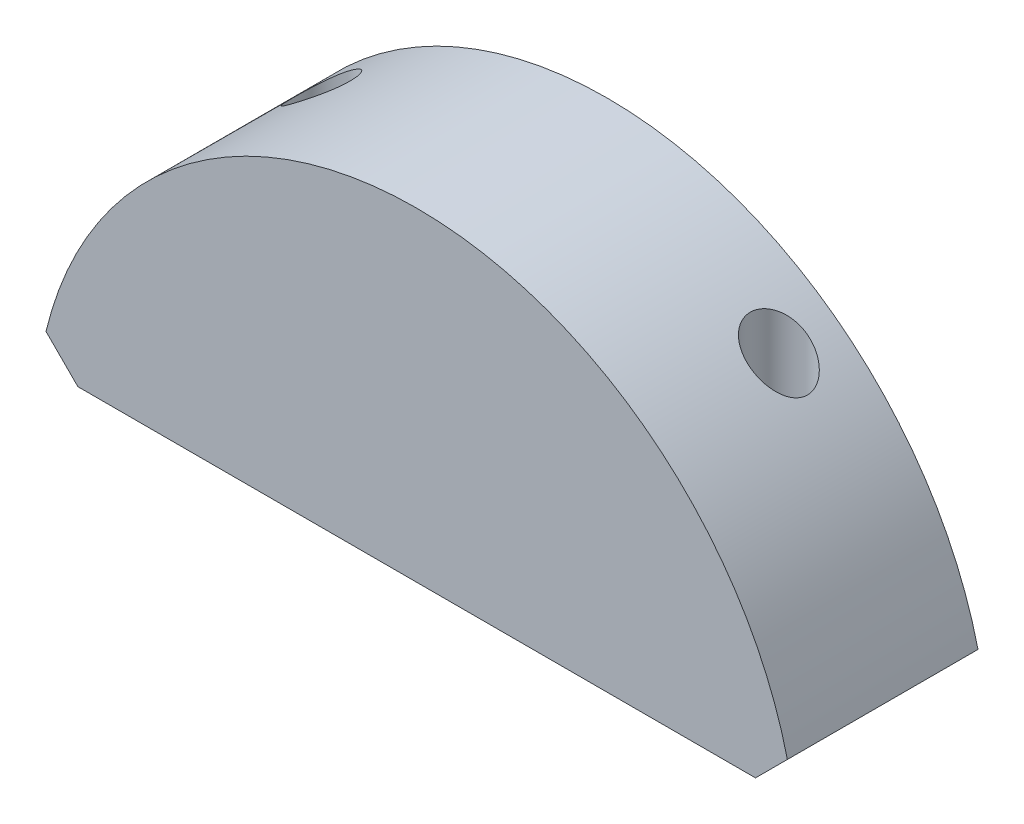
ISO-10303-21;
HEADER;
FILE_DESCRIPTION(('STEP AP214'),'2;1');
FILE_NAME('part.step','',(''),(''),'','','');
FILE_SCHEMA(('AUTOMOTIVE_DESIGN { 1 0 10303 214 1 1 1 1 }'));
ENDSEC;
DATA;
#1=APPLICATION_CONTEXT('core data for automotive mechanical design processes');
#2=APPLICATION_PROTOCOL_DEFINITION('international standard','automotive_design',2000,#1);
#3=PRODUCT_CONTEXT('',#1,'mechanical');
#4=PRODUCT('Part','Part','',(#3));
#5=PRODUCT_RELATED_PRODUCT_CATEGORY('part','',(#4));
#6=PRODUCT_DEFINITION_FORMATION('','',#4);
#7=PRODUCT_DEFINITION_CONTEXT('part definition',#1,'design');
#8=PRODUCT_DEFINITION('design','',#6,#7);
#9=PRODUCT_DEFINITION_SHAPE('','',#8);
#10=(LENGTH_UNIT() NAMED_UNIT(*) SI_UNIT(.MILLI.,.METRE.));
#11=(NAMED_UNIT(*) PLANE_ANGLE_UNIT() SI_UNIT($,.RADIAN.));
#12=(NAMED_UNIT(*) SI_UNIT($,.STERADIAN.) SOLID_ANGLE_UNIT());
#13=UNCERTAINTY_MEASURE_WITH_UNIT(LENGTH_MEASURE(1.E-05),#10,'distance_accuracy_value','');
#14=(GEOMETRIC_REPRESENTATION_CONTEXT(3) GLOBAL_UNCERTAINTY_ASSIGNED_CONTEXT((#13)) GLOBAL_UNIT_ASSIGNED_CONTEXT((#10,
#11,#12)) REPRESENTATION_CONTEXT('',''));
#15=CARTESIAN_POINT('',(0.,0.,0.));
#16=DIRECTION('',(0.,0.,1.));
#17=DIRECTION('',(1.,0.,0.));
#18=AXIS2_PLACEMENT_3D('',#15,#16,#17);
#19=CARTESIAN_POINT('',(-19.4464743814244,4.67275444813921,10.));
#20=DIRECTION('',(0.707106781186549,0.707106781186546,0.));
#21=DIRECTION('',(-0.707106781186546,0.707106781186549,0.));
#22=AXIS2_PLACEMENT_3D('',#19,#20,#21);
#23=PLANE('',#22);
#24=DIRECTION('',(0.707106781186546,-0.707106781186549,0.));
#25=VECTOR('',#24,1.);
#26=CARTESIAN_POINT('',(-19.4464743814244,4.67275444813921,0.));
#27=LINE('',#26,#25);
#28=CARTESIAN_POINT('',(-19.4464743814244,4.67275444813921,0.));
#29=VERTEX_POINT('',#28);
#30=CARTESIAN_POINT('',(-17.7737199332852,3.,0.));
#31=VERTEX_POINT('',#30);
#32=EDGE_CURVE('E100',#29,#31,#27,.T.);
#33=ORIENTED_EDGE('',*,*,#32,.T.);
#34=DIRECTION('',(0.,0.,-1.));
#35=VECTOR('',#34,1.);
#36=CARTESIAN_POINT('',(-17.7737199332852,3.,10.));
#37=LINE('',#36,#35);
#38=CARTESIAN_POINT('',(-17.7737199332852,3.,10.));
#39=VERTEX_POINT('',#38);
#40=EDGE_CURVE('E11',#39,#31,#37,.T.);
#41=ORIENTED_EDGE('',*,*,#40,.F.);
#42=DIRECTION('',(0.707106781186546,-0.707106781186549,0.));
#43=VECTOR('',#42,1.);
#44=CARTESIAN_POINT('',(-19.4464743814244,4.67275444813921,10.));
#45=LINE('',#44,#43);
#46=CARTESIAN_POINT('',(-19.4464743814244,4.67275444813921,10.));
#47=VERTEX_POINT('',#46);
#48=EDGE_CURVE('E87',#47,#39,#45,.T.);
#49=ORIENTED_EDGE('',*,*,#48,.F.);
#50=DIRECTION('',(0.,0.,-1.));
#51=VECTOR('',#50,1.);
#52=CARTESIAN_POINT('',(-19.4464743814244,4.67275444813921,10.));
#53=LINE('',#52,#51);
#54=EDGE_CURVE('E96',#47,#29,#53,.T.);
#55=ORIENTED_EDGE('',*,*,#54,.T.);
#56=EDGE_LOOP('',(#33,#41,#49,#55));
#57=FACE_BOUND('',#56,.T.);
#58=ADVANCED_FACE('F30',(#57),#23,.F.);
#59=CARTESIAN_POINT('',(17.7737199332852,3.,10.));
#60=DIRECTION('',(0.,1.,0.));
#61=DIRECTION('',(0.,0.,1.));
#62=AXIS2_PLACEMENT_3D('',#59,#60,#61);
#63=PLANE('',#62);
#64=CARTESIAN_POINT('',(12.,3.,3.));
#65=DIRECTION('',(0.,-1.,0.));
#66=DIRECTION('',(0.,0.,1.));
#67=AXIS2_PLACEMENT_3D('',#64,#65,#66);
#68=CIRCLE('',#67,1.5);
#69=CARTESIAN_POINT('',(12.,3.,4.5));
#70=VERTEX_POINT('',#69);
#71=EDGE_CURVE('E148',#70,#70,#68,.T.);
#72=ORIENTED_EDGE('',*,*,#71,.F.);
#73=EDGE_LOOP('',(#72));
#74=FACE_BOUND('',#73,.T.);
#75=CARTESIAN_POINT('',(-12.,3.,3.));
#76=DIRECTION('',(0.,-1.,0.));
#77=DIRECTION('',(0.,0.,-1.));
#78=AXIS2_PLACEMENT_3D('',#75,#76,#77);
#79=CIRCLE('',#78,1.5);
#80=CARTESIAN_POINT('',(-12.,3.,1.5));
#81=VERTEX_POINT('',#80);
#82=EDGE_CURVE('E112',#81,#81,#79,.T.);
#83=ORIENTED_EDGE('',*,*,#82,.F.);
#84=EDGE_LOOP('',(#83));
#85=FACE_BOUND('',#84,.T.);
#86=DIRECTION('',(1.,0.,0.));
#87=VECTOR('',#86,1.);
#88=CARTESIAN_POINT('',(17.7737199332852,3.,0.));
#89=LINE('',#88,#87);
#90=CARTESIAN_POINT('',(17.7737199332852,3.,0.));
#91=VERTEX_POINT('',#90);
#92=EDGE_CURVE('E91',#31,#91,#89,.T.);
#93=ORIENTED_EDGE('',*,*,#92,.T.);
#94=DIRECTION('',(0.,0.,-1.));
#95=VECTOR('',#94,1.);
#96=CARTESIAN_POINT('',(17.7737199332852,3.,10.));
#97=LINE('',#96,#95);
#98=CARTESIAN_POINT('',(17.7737199332852,3.,10.));
#99=VERTEX_POINT('',#98);
#100=EDGE_CURVE('E43',#99,#91,#97,.T.);
#101=ORIENTED_EDGE('',*,*,#100,.F.);
#102=DIRECTION('',(1.,0.,0.));
#103=VECTOR('',#102,1.);
#104=CARTESIAN_POINT('',(17.7737199332852,3.,10.));
#105=LINE('',#104,#103);
#106=EDGE_CURVE('E82',#39,#99,#105,.T.);
#107=ORIENTED_EDGE('',*,*,#106,.F.);
#108=ORIENTED_EDGE('',*,*,#40,.T.);
#109=EDGE_LOOP('',(#93,#101,#107,#108));
#110=FACE_BOUND('',#109,.T.);
#111=ADVANCED_FACE('F90',(#74,#85,#110),#63,.F.);
#112=CARTESIAN_POINT('',(19.4464743814244,4.67275444813921,10.));
#113=DIRECTION('',(-0.707106781186549,0.707106781186546,0.));
#114=DIRECTION('',(-0.707106781186546,-0.707106781186549,0.));
#115=AXIS2_PLACEMENT_3D('',#112,#113,#114);
#116=PLANE('',#115);
#117=DIRECTION('',(0.707106781186546,0.707106781186549,0.));
#118=VECTOR('',#117,1.);
#119=CARTESIAN_POINT('',(19.4464743814244,4.67275444813921,0.));
#120=LINE('',#119,#118);
#121=CARTESIAN_POINT('',(19.4464743814244,4.67275444813921,0.));
#122=VERTEX_POINT('',#121);
#123=EDGE_CURVE('E69',#91,#122,#120,.T.);
#124=ORIENTED_EDGE('',*,*,#123,.T.);
#125=DIRECTION('',(0.,0.,-1.));
#126=VECTOR('',#125,1.);
#127=CARTESIAN_POINT('',(19.4464743814244,4.67275444813921,10.));
#128=LINE('',#127,#126);
#129=CARTESIAN_POINT('',(19.4464743814244,4.67275444813921,10.));
#130=VERTEX_POINT('',#129);
#131=EDGE_CURVE('E92',#130,#122,#128,.T.);
#132=ORIENTED_EDGE('',*,*,#131,.F.);
#133=DIRECTION('',(0.707106781186546,0.707106781186549,0.));
#134=VECTOR('',#133,1.);
#135=CARTESIAN_POINT('',(19.4464743814244,4.67275444813921,10.));
#136=LINE('',#135,#134);
#137=EDGE_CURVE('E85',#99,#130,#136,.T.);
#138=ORIENTED_EDGE('',*,*,#137,.F.);
#139=ORIENTED_EDGE('',*,*,#100,.T.);
#140=EDGE_LOOP('',(#124,#132,#138,#139));
#141=FACE_BOUND('',#140,.T.);
#142=ADVANCED_FACE('F94',(#141),#116,.F.);
#143=CARTESIAN_POINT('',(0.,0.,10.));
#144=DIRECTION('',(0.,0.,-1.));
#145=DIRECTION('',(-1.,0.,0.));
#146=AXIS2_PLACEMENT_3D('',#143,#144,#145);
#147=CYLINDRICAL_SURFACE('',#146,20.);
#148=CARTESIAN_POINT('',(12.,16.,1.5));
#149=CARTESIAN_POINT('',(12.1016605629213,15.9237532135887,1.50000004935669));
#150=CARTESIAN_POINT('',(12.2026127311578,15.8465127533473,1.51032097749191));
#151=CARTESIAN_POINT('',(12.400646022508,15.692029679866,1.55095839595559));
#152=CARTESIAN_POINT('',(12.4977205734092,15.6147872679916,1.58130742401025));
#153=CARTESIAN_POINT('',(12.6897064755142,15.4592138939535,1.6636898259232));
#154=CARTESIAN_POINT('',(12.7843139264481,15.3809957521567,1.71665472820429));
#155=CARTESIAN_POINT('',(12.9629089448135,15.2307751019965,1.8446545508195));
#156=CARTESIAN_POINT('',(13.0469231451528,15.1587571563415,1.91963247924919));
#157=CARTESIAN_POINT('',(13.1708907683445,15.0509697154233,2.05968444424559));
#158=CARTESIAN_POINT('',(13.2155595966016,15.0117279077581,2.11794607225101));
#159=CARTESIAN_POINT('',(13.2971797886314,14.9394765813178,2.24310888920046));
#160=CARTESIAN_POINT('',(13.3341434417936,14.9064571463541,2.30999604067372));
#161=CARTESIAN_POINT('',(13.3928015616609,14.8537589270902,2.43942400994441));
#162=CARTESIAN_POINT('',(13.4160296580088,14.8327617291017,2.50072726708063));
#163=CARTESIAN_POINT('',(13.4545746078482,14.7978073911107,2.62770451371875));
#164=CARTESIAN_POINT('',(13.4698962264855,14.7838460108185,2.69337584362389));
#165=CARTESIAN_POINT('',(13.4916421076157,14.7640041775769,2.82778097939976));
#166=CARTESIAN_POINT('',(13.4980169893861,14.7581685755147,2.89652963762857));
#167=CARTESIAN_POINT('',(13.5011884754028,14.755267420131,3.034429926871));
#168=CARTESIAN_POINT('',(13.4979872687585,14.7581998624203,3.10358146217927));
#169=CARTESIAN_POINT('',(13.4830012003276,14.7718909613274,3.23367914475481));
#170=CARTESIAN_POINT('',(13.472021382519,14.7819154999464,3.2948005649622));
#171=CARTESIAN_POINT('',(13.4430616303673,14.8082569634209,3.41392436688357));
#172=CARTESIAN_POINT('',(13.4250804124258,14.8245750420944,3.47192617444431));
#173=CARTESIAN_POINT('',(13.3816034948475,14.8638351659176,3.58757468259506));
#174=CARTESIAN_POINT('',(13.3556818304176,14.8871505567923,3.64493207249858));
#175=CARTESIAN_POINT('',(13.2980418159378,14.93866067761,3.75426441770425));
#176=CARTESIAN_POINT('',(13.2663196593158,14.9668586110726,3.80623580314361));
#177=CARTESIAN_POINT('',(13.1803316644731,15.0427260154491,3.9301005770873));
#178=CARTESIAN_POINT('',(13.1229220222838,15.0928947956917,3.99829629684761));
#179=CARTESIAN_POINT('',(12.9998708818308,15.1990132172518,4.12155049099019));
#180=CARTESIAN_POINT('',(12.9342108196884,15.2549758433967,4.17657849984266));
#181=CARTESIAN_POINT('',(12.7798704471203,15.384647055898,4.28560543116445));
#182=CARTESIAN_POINT('',(12.6894951910277,15.4593402629862,4.3360376663896));
#183=CARTESIAN_POINT('',(12.5022544047574,15.6111562300716,4.41709380697447));
#184=CARTESIAN_POINT('',(12.4053874483738,15.6882795219658,4.44771334369915));
#185=CARTESIAN_POINT('',(12.2069126063823,15.8432077026678,4.48913684669305));
#186=CARTESIAN_POINT('',(12.1052767364364,15.9210136356196,4.49980331807073));
#187=CARTESIAN_POINT('',(11.9004066568021,16.0747230306896,4.50019129806755));
#188=CARTESIAN_POINT('',(11.7971717440038,16.1506256151288,4.48990331756371));
#189=CARTESIAN_POINT('',(11.5899659066436,16.2999799219,4.44683044842385));
#190=CARTESIAN_POINT('',(11.4860287279132,16.3733410304183,4.41355576711111));
#191=CARTESIAN_POINT('',(11.2842193016896,16.5130665721538,4.32281232383725));
#192=CARTESIAN_POINT('',(11.1863337294807,16.5794466204968,4.26539905840293));
#193=CARTESIAN_POINT('',(11.0315673658264,16.6826343905496,4.14819763134882));
#194=CARTESIAN_POINT('',(10.9715216369123,16.7221477658731,4.09492647133967));
#195=CARTESIAN_POINT('',(10.8591649159862,16.7953271487328,3.97728953681393));
#196=CARTESIAN_POINT('',(10.806849595253,16.8289964305881,3.91293001540785));
#197=CARTESIAN_POINT('',(10.7121014961134,16.8894665285848,3.77360389767993));
#198=CARTESIAN_POINT('',(10.6697416979466,16.9162167589897,3.69856507407423));
#199=CARTESIAN_POINT('',(10.5979555941409,16.9612839160065,3.54019315187877));
#200=CARTESIAN_POINT('',(10.5685197408551,16.979607068653,3.45686623218193));
#201=CARTESIAN_POINT('',(10.5273605290395,17.0051519510712,3.2956014016712));
#202=CARTESIAN_POINT('',(10.5138907603318,17.0134701997499,3.21828040882406));
#203=CARTESIAN_POINT('',(10.4992362845085,17.0225179869444,3.06205860237886));
#204=CARTESIAN_POINT('',(10.4980447598979,17.023251736754,2.9831586898644));
#205=CARTESIAN_POINT('',(10.5076087948478,17.0173493215066,2.83265056278279));
#206=CARTESIAN_POINT('',(10.5174310204263,17.0112889192493,2.76095738189619));
#207=CARTESIAN_POINT('',(10.5470279795145,16.9929544491812,2.62049671268836));
#208=CARTESIAN_POINT('',(10.5668022281685,16.9806806840812,2.55172908201334));
#209=CARTESIAN_POINT('',(10.6156676939691,16.950175007428,2.41796748732423));
#210=CARTESIAN_POINT('',(10.6448759171302,16.9318682092376,2.35303371512348));
#211=CARTESIAN_POINT('',(10.7112488596221,16.8899580945463,2.22924846857253));
#212=CARTESIAN_POINT('',(10.748415802057,16.8663532980698,2.17039870048799));
#213=CARTESIAN_POINT('',(10.8329398860586,16.8122022490995,2.05472177457169));
#214=CARTESIAN_POINT('',(10.8809116539043,16.781223570887,1.99854817905674));
#215=CARTESIAN_POINT('',(10.9828767468486,16.7146680692949,1.89512800668806));
#216=CARTESIAN_POINT('',(11.0368729409546,16.679089053808,1.8478857122846));
#217=CARTESIAN_POINT('',(11.1574088396454,16.5987406196212,1.7563920114594));
#218=CARTESIAN_POINT('',(11.2246335533111,16.553386112853,1.71355962226389));
#219=CARTESIAN_POINT('',(11.3627962910017,16.4588542389145,1.63981128319862));
#220=CARTESIAN_POINT('',(11.4337361929509,16.4096749322021,1.6089014271738));
#221=CARTESIAN_POINT('',(11.5867739353569,16.3020390843075,1.55548706424555));
#222=CARTESIAN_POINT('',(11.6691455209899,16.2431971369261,1.53454650227289));
#223=CARTESIAN_POINT('',(11.8345001333518,16.1231224094826,1.50679968712444));
#224=CARTESIAN_POINT('',(11.9174834246622,16.0618885388235,1.4999999599378));
#225=CARTESIAN_POINT('',(12.,16.,1.5));
#226=B_SPLINE_CURVE_WITH_KNOTS('',3,(#148,#149,#150,#151,#152,#153,#154,#155,#156,#157,#158,
#159,#160,#161,#162,#163,#164,#165,#166,#167,#168,#169,#170,#171,#172,#173,#174,#175,#176,#177,
#178,#179,#180,#181,#182,#183,#184,#185,#186,#187,#188,#189,#190,#191,#192,#193,#194,#195,#196,
#197,#198,#199,#200,#201,#202,#203,#204,#205,#206,#207,#208,#209,#210,#211,#212,#213,#214,#215,
#216,#217,#218,#219,#220,#221,#222,#223,#224,#225),.UNSPECIFIED.,.T.,.F.,(4,2,2,2,2,2,2,2,2,2,2,
2,2,2,2,2,2,2,2,2,2,2,2,2,2,2,2,2,2,2,2,2,2,2,2,2,2,2,4),(0.,0.380888747448679,
0.762397816573691,1.16142131309411,1.55942070996349,1.80831992799634,2.0568190736621,
2.26249204307297,2.46804091048419,2.67471988367374,2.88135161332349,3.06923797234161,
3.25715879364833,3.45778881821748,3.6585509818516,3.96373327729259,4.26961497597763,
4.65056330466912,5.03159560261999,5.41524402539657,5.79906622014661,6.19132971875761,
6.58269626178779,6.85005253143594,7.11725852021268,7.38636612164723,7.6552745822342,
7.89076947911889,8.12613361041183,8.34296500964325,8.55978584602022,8.77940632412541,
8.99908822889553,9.23845155373438,9.47792936089046,9.7520175092024,10.0262455643914,
10.3352654956433,10.644428007841),.UNSPECIFIED.);
#227=CARTESIAN_POINT('',(12.,16.,1.5));
#228=VERTEX_POINT('',#227);
#229=EDGE_CURVE('E33',#228,#228,#226,.T.);
#230=ORIENTED_EDGE('',*,*,#229,.T.);
#231=EDGE_LOOP('',(#230));
#232=FACE_BOUND('',#231,.T.);
#233=CARTESIAN_POINT('',(-12.,16.,1.5));
#234=CARTESIAN_POINT('',(-11.8980876048335,16.0764323170644,1.5000003600341));
#235=CARTESIAN_POINT('',(-11.795374042595,16.1519339106007,1.51037246279794));
#236=CARTESIAN_POINT('',(-11.5913536327377,16.2989669800117,1.55298029084801));
#237=CARTESIAN_POINT('',(-11.490048209334,16.3704946286235,1.58523671089141));
#238=CARTESIAN_POINT('',(-11.3142543425323,16.4923175647519,1.66324681195698));
#239=CARTESIAN_POINT('',(-11.238684524381,16.5438706292671,1.70460518809169));
#240=CARTESIAN_POINT('',(-11.0935488275665,16.6415381162207,1.80169184783767));
#241=CARTESIAN_POINT('',(-11.0239734845288,16.6876611556738,1.85739690400877));
#242=CARTESIAN_POINT('',(-10.9036247460083,16.7664950196489,1.9734244783802));
#243=CARTESIAN_POINT('',(-10.8515983746704,16.8001794997242,2.03178224968919));
#244=CARTESIAN_POINT('',(-10.7561004107026,16.8614804890711,2.15799817758912));
#245=CARTESIAN_POINT('',(-10.7126274551483,16.8890979651574,2.22585481765071));
#246=CARTESIAN_POINT('',(-10.6361897009943,16.9373414907645,2.37014029400427));
#247=CARTESIAN_POINT('',(-10.6032891874942,16.9579248158376,2.44661788923494));
#248=CARTESIAN_POINT('',(-10.5503692934813,16.9909003915396,2.60557412620413));
#249=CARTESIAN_POINT('',(-10.5303416713673,17.0032978831174,2.68804889064996));
#250=CARTESIAN_POINT('',(-10.5059450850056,17.0183811355177,2.84666531717342));
#251=CARTESIAN_POINT('',(-10.5000833890813,17.0219930061228,2.92249230541015));
#252=CARTESIAN_POINT('',(-10.4999184896842,17.0220948966151,3.07414954399625));
#253=CARTESIAN_POINT('',(-10.5056110395502,17.0185875331139,3.14997978290739));
#254=CARTESIAN_POINT('',(-10.5276429980599,17.0049664536379,3.29547769185223));
#255=CARTESIAN_POINT('',(-10.5434291725354,16.9951959546369,3.36526304483569));
#256=CARTESIAN_POINT('',(-10.5843294661826,16.969753845377,3.50089488696362));
#257=CARTESIAN_POINT('',(-10.6094442044875,16.9540818434367,3.566741114333));
#258=CARTESIAN_POINT('',(-10.6689917240703,16.9166749481416,3.69543796905904));
#259=CARTESIAN_POINT('',(-10.7037411921448,16.894733040342,3.75808090296772));
#260=CARTESIAN_POINT('',(-10.7806361565001,16.8457697707144,3.87643513553549));
#261=CARTESIAN_POINT('',(-10.822784220928,16.8187466448983,3.9321440157829));
#262=CARTESIAN_POINT('',(-10.9178890891895,16.7571845534856,4.04155760309163));
#263=CARTESIAN_POINT('',(-10.9715220318902,16.7221486702822,4.09439267118534));
#264=CARTESIAN_POINT('',(-11.0841830982763,16.6476860793537,4.1902774291558));
#265=CARTESIAN_POINT('',(-11.1432139512592,16.6082571481853,4.23332213002933));
#266=CARTESIAN_POINT('',(-11.274541163793,16.5194409670355,4.31552589431466));
#267=CARTESIAN_POINT('',(-11.3474700975539,16.4694598846249,4.35303035551361));
#268=CARTESIAN_POINT('',(-11.4962221492973,16.365974093831,4.41517346469698));
#269=CARTESIAN_POINT('',(-11.57204683658,16.3124674631152,4.43980502715793));
#270=CARTESIAN_POINT('',(-11.7381442890676,16.1934588757011,4.47984368956888));
#271=CARTESIAN_POINT('',(-11.8286439442075,16.1274849369142,4.4929128422832));
#272=CARTESIAN_POINT('',(-12.0091013673207,15.9935657699963,4.50269618316554));
#273=CARTESIAN_POINT('',(-12.0990586138851,15.9256189261905,4.49939656809969));
#274=CARTESIAN_POINT('',(-12.2890846402055,15.7795653555701,4.47541502690279));
#275=CARTESIAN_POINT('',(-12.3887946092472,15.7013746346254,4.45235201009592));
#276=CARTESIAN_POINT('',(-12.5825891709098,15.5465051671632,4.38603019746868));
#277=CARTESIAN_POINT('',(-12.6766737297221,15.4698264297345,4.34277128028547));
#278=CARTESIAN_POINT('',(-12.8411398943842,15.3334455836701,4.24499890082287));
#279=CARTESIAN_POINT('',(-12.9128361125113,15.2730688976113,4.1936358138155));
#280=CARTESIAN_POINT('',(-13.0483034816434,15.1574951967083,4.07659138836794));
#281=CARTESIAN_POINT('',(-13.1120862077628,15.1022906462167,4.0109313591837));
#282=CARTESIAN_POINT('',(-13.2148223778713,15.0123937614299,3.8827425817465));
#283=CARTESIAN_POINT('',(-13.2560565832223,14.9759628036903,3.82326569708388));
#284=CARTESIAN_POINT('',(-13.3306489346558,14.9096037748145,3.69625877104046));
#285=CARTESIAN_POINT('',(-13.3640173563308,14.8796672237292,3.62873941171168));
#286=CARTESIAN_POINT('',(-13.4160912652458,14.8327177492785,3.49872011198761));
#287=CARTESIAN_POINT('',(-13.4363251312712,14.8143729529233,3.43731832757045));
#288=CARTESIAN_POINT('',(-13.4688959978802,14.7847668318338,3.31080612958904));
#289=CARTESIAN_POINT('',(-13.4812382565596,14.7735007906854,3.24569821694375));
#290=CARTESIAN_POINT('',(-13.4972125275386,14.7589084124947,3.11323211597964));
#291=CARTESIAN_POINT('',(-13.5008065126064,14.7556167389417,3.04586538928481));
#292=CARTESIAN_POINT('',(-13.498888726625,14.7573711983825,2.91137397683958));
#293=CARTESIAN_POINT('',(-13.4933773865565,14.7624169367433,2.84424927978396));
#294=CARTESIAN_POINT('',(-13.4743664275154,14.7797697752896,2.71698321890953));
#295=CARTESIAN_POINT('',(-13.4614456888825,14.7915505002326,2.65667996533801));
#296=CARTESIAN_POINT('',(-13.4288598155293,14.8211405270667,2.53949536743534));
#297=CARTESIAN_POINT('',(-13.409192016344,14.8389522105928,2.48261538542665));
#298=CARTESIAN_POINT('',(-13.3564790722021,14.886440101642,2.35486471316348));
#299=CARTESIAN_POINT('',(-13.3211599585108,14.9180920605353,2.28566605417657));
#300=CARTESIAN_POINT('',(-13.2422954098062,14.9881420541817,2.15590632220091));
#301=CARTESIAN_POINT('',(-13.1987348329528,15.0265524968956,2.09536151394654));
#302=CARTESIAN_POINT('',(-13.0908551109943,15.1207161398019,1.9660109217337));
#303=CARTESIAN_POINT('',(-13.0242636211823,15.1781786427428,1.90035103105235));
#304=CARTESIAN_POINT('',(-12.8830820444135,15.2981964808271,1.78404266330934));
#305=CARTESIAN_POINT('',(-12.8084817401896,15.3607582963496,1.73341367942219));
#306=CARTESIAN_POINT('',(-12.6519333620279,15.4899672505474,1.64605381787775));
#307=CARTESIAN_POINT('',(-12.5698699134902,15.5566704339982,1.60961485293945));
#308=CARTESIAN_POINT('',(-12.4016331516331,15.6911140433194,1.55204375884532));
#309=CARTESIAN_POINT('',(-12.3154680566121,15.7588522245281,1.53088228976567));
#310=CARTESIAN_POINT('',(-12.1527976286699,15.8845389200665,1.50586275371052));
#311=CARTESIAN_POINT('',(-12.0766252699605,15.9425325357214,1.49999972929976));
#312=CARTESIAN_POINT('',(-12.,16.,1.5));
#313=B_SPLINE_CURVE_WITH_KNOTS('',3,(#233,#234,#235,#236,#237,#238,#239,#240,#241,#242,#243,
#244,#245,#246,#247,#248,#249,#250,#251,#252,#253,#254,#255,#256,#257,#258,#259,#260,#261,#262,
#263,#264,#265,#266,#267,#268,#269,#270,#271,#272,#273,#274,#275,#276,#277,#278,#279,#280,#281,
#282,#283,#284,#285,#286,#287,#288,#289,#290,#291,#292,#293,#294,#295,#296,#297,#298,#299,#300,
#301,#302,#303,#304,#305,#306,#307,#308,#309,#310,#311,#312),.UNSPECIFIED.,.T.,.F.,(4,2,2,2,2,2,
2,2,2,2,2,2,2,2,2,2,2,2,2,2,2,2,2,2,2,2,2,2,2,2,2,2,2,2,2,2,2,2,2,4),(0.,0.381852199418809,
0.764065999032913,1.06407114404965,1.36359359760288,1.6179247857578,1.87221541521554,
2.12802420556192,2.38366905608251,2.61090583488865,2.8380591099448,3.05371988379746,
3.26939497353044,3.49323274921014,3.7171483760326,3.9653010717218,4.21357993985852,
4.50060331369063,4.78778450548272,5.12472758268657,5.46195484098148,5.84664473760215,
6.23133694596236,6.55082545209374,6.86984098854433,7.11205322940871,7.35394727680873,
7.55471734421932,7.75535350083712,7.9568602429058,8.15835744736855,8.34591796191896,
8.5335526309587,8.78385434465488,9.03462047772725,9.36216090756058,9.69012427850932,
10.024516974717,10.3582657600676,10.6453704622747),.UNSPECIFIED.);
#314=CARTESIAN_POINT('',(-12.,16.,1.5));
#315=VERTEX_POINT('',#314);
#316=EDGE_CURVE('E103',#315,#315,#313,.T.);
#317=ORIENTED_EDGE('',*,*,#316,.T.);
#318=EDGE_LOOP('',(#317));
#319=FACE_BOUND('',#318,.T.);
#320=CARTESIAN_POINT('',(0.,0.,0.));
#321=DIRECTION('',(0.,0.,1.));
#322=DIRECTION('',(1.,0.,0.));
#323=AXIS2_PLACEMENT_3D('',#320,#321,#322);
#324=CIRCLE('',#323,20.);
#325=EDGE_CURVE('E75',#122,#29,#324,.T.);
#326=ORIENTED_EDGE('',*,*,#325,.T.);
#327=ORIENTED_EDGE('',*,*,#54,.F.);
#328=CARTESIAN_POINT('',(0.,0.,10.));
#329=DIRECTION('',(0.,0.,1.));
#330=DIRECTION('',(1.,0.,0.));
#331=AXIS2_PLACEMENT_3D('',#328,#329,#330);
#332=CIRCLE('',#331,20.);
#333=EDGE_CURVE('E52',#130,#47,#332,.T.);
#334=ORIENTED_EDGE('',*,*,#333,.F.);
#335=ORIENTED_EDGE('',*,*,#131,.T.);
#336=EDGE_LOOP('',(#326,#327,#334,#335));
#337=FACE_BOUND('',#336,.T.);
#338=ADVANCED_FACE('F113',(#232,#319,#337),#147,.T.);
#339=CARTESIAN_POINT('',(0.,0.,10.));
#340=DIRECTION('',(0.,0.,1.));
#341=DIRECTION('',(1.,0.,0.));
#342=AXIS2_PLACEMENT_3D('',#339,#340,#341);
#343=PLANE('',#342);
#344=ORIENTED_EDGE('',*,*,#48,.T.);
#345=ORIENTED_EDGE('',*,*,#106,.T.);
#346=ORIENTED_EDGE('',*,*,#137,.T.);
#347=ORIENTED_EDGE('',*,*,#333,.T.);
#348=EDGE_LOOP('',(#344,#345,#346,#347));
#349=FACE_BOUND('',#348,.T.);
#350=ADVANCED_FACE('F83',(#349),#343,.T.);
#351=CARTESIAN_POINT('',(0.,0.,0.));
#352=DIRECTION('',(0.,0.,1.));
#353=DIRECTION('',(1.,0.,0.));
#354=AXIS2_PLACEMENT_3D('',#351,#352,#353);
#355=PLANE('',#354);
#356=ORIENTED_EDGE('',*,*,#32,.F.);
#357=ORIENTED_EDGE('',*,*,#325,.F.);
#358=ORIENTED_EDGE('',*,*,#123,.F.);
#359=ORIENTED_EDGE('',*,*,#92,.F.);
#360=EDGE_LOOP('',(#356,#357,#358,#359));
#361=FACE_BOUND('',#360,.T.);
#362=ADVANCED_FACE('F122',(#361),#355,.F.);
#363=CARTESIAN_POINT('',(-12.,20.,3.));
#364=DIRECTION('',(0.,-1.,0.));
#365=DIRECTION('',(0.,0.,-1.));
#366=AXIS2_PLACEMENT_3D('',#363,#364,#365);
#367=CYLINDRICAL_SURFACE('',#366,1.5);
#368=ORIENTED_EDGE('',*,*,#82,.T.);
#369=EDGE_LOOP('',(#368));
#370=FACE_BOUND('',#369,.T.);
#371=ORIENTED_EDGE('',*,*,#316,.F.);
#372=EDGE_LOOP('',(#371));
#373=FACE_BOUND('',#372,.T.);
#374=ADVANCED_FACE('F117',(#370,#373),#367,.F.);
#375=CARTESIAN_POINT('',(12.,20.,3.));
#376=DIRECTION('',(0.,-1.,0.));
#377=DIRECTION('',(0.,0.,-1.));
#378=AXIS2_PLACEMENT_3D('',#375,#376,#377);
#379=CYLINDRICAL_SURFACE('',#378,1.5);
#380=ORIENTED_EDGE('',*,*,#71,.T.);
#381=EDGE_LOOP('',(#380));
#382=FACE_BOUND('',#381,.T.);
#383=ORIENTED_EDGE('',*,*,#229,.F.);
#384=EDGE_LOOP('',(#383));
#385=FACE_BOUND('',#384,.T.);
#386=ADVANCED_FACE('F121',(#382,#385),#379,.F.);
#387=CLOSED_SHELL('',(#58,#111,#142,#338,#350,#362,#374,#386));
#388=MANIFOLD_SOLID_BREP('B2',#387);
#389=ADVANCED_BREP_SHAPE_REPRESENTATION('',(#18,#388),#14);
#390=SHAPE_DEFINITION_REPRESENTATION(#9,#389);
ENDSEC;
END-ISO-10303-21;
